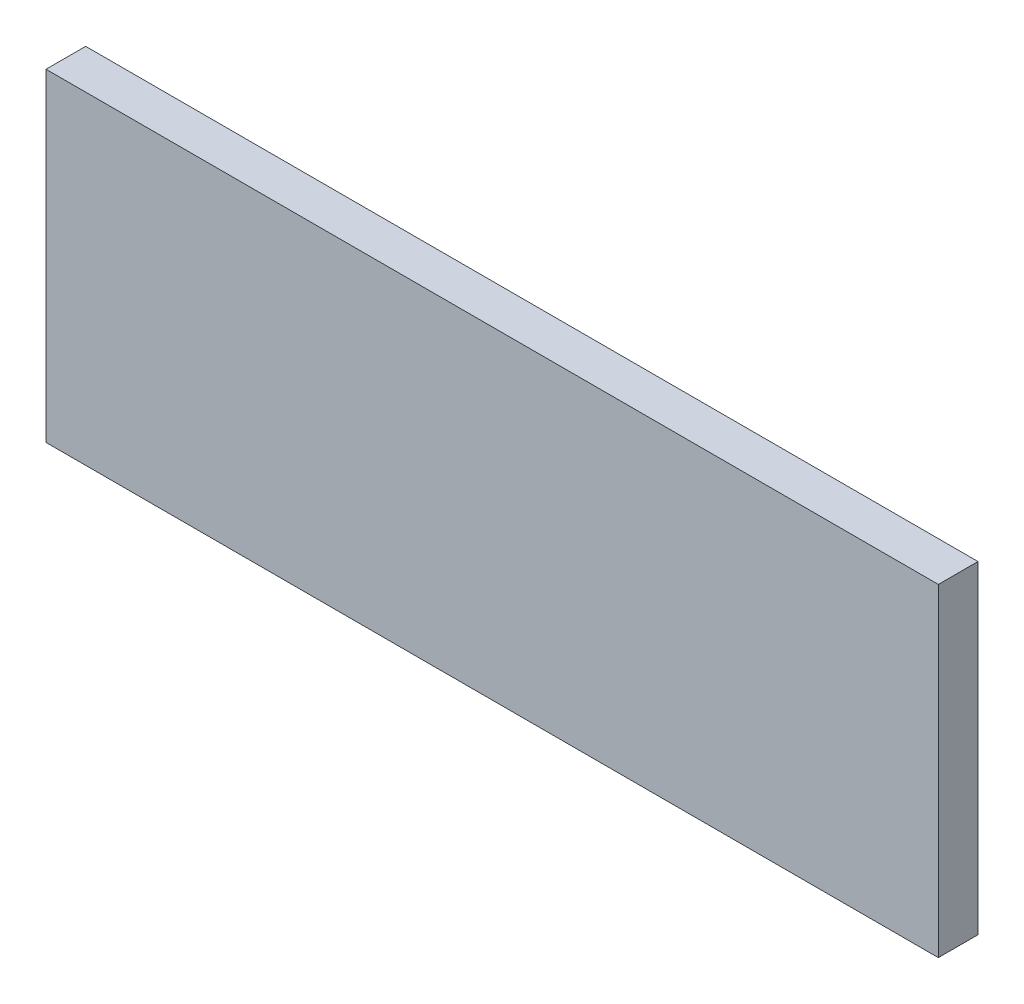
ISO-10303-21;
HEADER;
FILE_DESCRIPTION(('STEP AP214'),'2;1');
FILE_NAME('part.step','',(''),(''),'','','');
FILE_SCHEMA(('AUTOMOTIVE_DESIGN { 1 0 10303 214 1 1 1 1 }'));
ENDSEC;
DATA;
#1=APPLICATION_CONTEXT('core data for automotive mechanical design processes');
#2=APPLICATION_PROTOCOL_DEFINITION('international standard','automotive_design',2000,#1);
#3=PRODUCT_CONTEXT('',#1,'mechanical');
#4=PRODUCT('Part','Part','',(#3));
#5=PRODUCT_RELATED_PRODUCT_CATEGORY('part','',(#4));
#6=PRODUCT_DEFINITION_FORMATION('','',#4);
#7=PRODUCT_DEFINITION_CONTEXT('part definition',#1,'design');
#8=PRODUCT_DEFINITION('design','',#6,#7);
#9=PRODUCT_DEFINITION_SHAPE('','',#8);
#10=(LENGTH_UNIT() NAMED_UNIT(*) SI_UNIT(.MILLI.,.METRE.));
#11=(NAMED_UNIT(*) PLANE_ANGLE_UNIT() SI_UNIT($,.RADIAN.));
#12=(NAMED_UNIT(*) SI_UNIT($,.STERADIAN.) SOLID_ANGLE_UNIT());
#13=UNCERTAINTY_MEASURE_WITH_UNIT(LENGTH_MEASURE(1.E-05),#10,'distance_accuracy_value','');
#14=(GEOMETRIC_REPRESENTATION_CONTEXT(3) GLOBAL_UNCERTAINTY_ASSIGNED_CONTEXT((#13)) GLOBAL_UNIT_ASSIGNED_CONTEXT((#10,
#11,#12)) REPRESENTATION_CONTEXT('',''));
#15=CARTESIAN_POINT('',(0.,0.,0.));
#16=DIRECTION('',(0.,0.,1.));
#17=DIRECTION('',(1.,0.,0.));
#18=AXIS2_PLACEMENT_3D('',#15,#16,#17);
#19=CARTESIAN_POINT('',(225.,-81.5,20.));
#20=DIRECTION('',(-1.,0.,0.));
#21=DIRECTION('',(0.,0.,1.));
#22=AXIS2_PLACEMENT_3D('',#19,#20,#21);
#23=PLANE('',#22);
#24=DIRECTION('',(0.,1.,0.));
#25=VECTOR('',#24,1.);
#26=CARTESIAN_POINT('',(225.,-81.5,0.));
#27=LINE('',#26,#25);
#28=CARTESIAN_POINT('',(225.,-81.5,0.));
#29=VERTEX_POINT('',#28);
#30=CARTESIAN_POINT('',(225.,81.5,0.));
#31=VERTEX_POINT('',#30);
#32=EDGE_CURVE('E106',#29,#31,#27,.T.);
#33=ORIENTED_EDGE('',*,*,#32,.T.);
#34=DIRECTION('',(0.,0.,-1.));
#35=VECTOR('',#34,1.);
#36=CARTESIAN_POINT('',(225.,81.5,20.));
#37=LINE('',#36,#35);
#38=CARTESIAN_POINT('',(225.,81.5,20.));
#39=VERTEX_POINT('',#38);
#40=EDGE_CURVE('E11',#39,#31,#37,.T.);
#41=ORIENTED_EDGE('',*,*,#40,.F.);
#42=DIRECTION('',(0.,1.,0.));
#43=VECTOR('',#42,1.);
#44=CARTESIAN_POINT('',(225.,-81.5,20.));
#45=LINE('',#44,#43);
#46=CARTESIAN_POINT('',(225.,-81.5,20.));
#47=VERTEX_POINT('',#46);
#48=EDGE_CURVE('E90',#47,#39,#45,.T.);
#49=ORIENTED_EDGE('',*,*,#48,.F.);
#50=DIRECTION('',(0.,0.,-1.));
#51=VECTOR('',#50,1.);
#52=CARTESIAN_POINT('',(225.,-81.5,20.));
#53=LINE('',#52,#51);
#54=EDGE_CURVE('E102',#47,#29,#53,.T.);
#55=ORIENTED_EDGE('',*,*,#54,.T.);
#56=EDGE_LOOP('',(#33,#41,#49,#55));
#57=FACE_BOUND('',#56,.T.);
#58=ADVANCED_FACE('F38',(#57),#23,.F.);
#59=CARTESIAN_POINT('',(-225.,81.5,20.));
#60=DIRECTION('',(0.,-1.,0.));
#61=DIRECTION('',(0.,0.,-1.));
#62=AXIS2_PLACEMENT_3D('',#59,#60,#61);
#63=PLANE('',#62);
#64=DIRECTION('',(-1.,0.,0.));
#65=VECTOR('',#64,1.);
#66=CARTESIAN_POINT('',(-225.,81.5,0.));
#67=LINE('',#66,#65);
#68=CARTESIAN_POINT('',(-225.,81.5,0.));
#69=VERTEX_POINT('',#68);
#70=EDGE_CURVE('E95',#31,#69,#67,.T.);
#71=ORIENTED_EDGE('',*,*,#70,.T.);
#72=DIRECTION('',(0.,0.,-1.));
#73=VECTOR('',#72,1.);
#74=CARTESIAN_POINT('',(-225.,81.5,20.));
#75=LINE('',#74,#73);
#76=CARTESIAN_POINT('',(-225.,81.5,20.));
#77=VERTEX_POINT('',#76);
#78=EDGE_CURVE('E47',#77,#69,#75,.T.);
#79=ORIENTED_EDGE('',*,*,#78,.F.);
#80=DIRECTION('',(-1.,0.,0.));
#81=VECTOR('',#80,1.);
#82=CARTESIAN_POINT('',(-225.,81.5,20.));
#83=LINE('',#82,#81);
#84=EDGE_CURVE('E85',#39,#77,#83,.T.);
#85=ORIENTED_EDGE('',*,*,#84,.F.);
#86=ORIENTED_EDGE('',*,*,#40,.T.);
#87=EDGE_LOOP('',(#71,#79,#85,#86));
#88=FACE_BOUND('',#87,.T.);
#89=ADVANCED_FACE('F94',(#88),#63,.F.);
#90=CARTESIAN_POINT('',(-225.,-81.5,20.));
#91=DIRECTION('',(1.,0.,0.));
#92=DIRECTION('',(0.,0.,-1.));
#93=AXIS2_PLACEMENT_3D('',#90,#91,#92);
#94=PLANE('',#93);
#95=DIRECTION('',(0.,-1.,0.));
#96=VECTOR('',#95,1.);
#97=CARTESIAN_POINT('',(-225.,-81.5,0.));
#98=LINE('',#97,#96);
#99=CARTESIAN_POINT('',(-225.,-81.5,0.));
#100=VERTEX_POINT('',#99);
#101=EDGE_CURVE('E72',#69,#100,#98,.T.);
#102=ORIENTED_EDGE('',*,*,#101,.T.);
#103=DIRECTION('',(0.,0.,-1.));
#104=VECTOR('',#103,1.);
#105=CARTESIAN_POINT('',(-225.,-81.5,20.));
#106=LINE('',#105,#104);
#107=CARTESIAN_POINT('',(-225.,-81.5,20.));
#108=VERTEX_POINT('',#107);
#109=EDGE_CURVE('E97',#108,#100,#106,.T.);
#110=ORIENTED_EDGE('',*,*,#109,.F.);
#111=DIRECTION('',(0.,-1.,0.));
#112=VECTOR('',#111,1.);
#113=CARTESIAN_POINT('',(-225.,-81.5,20.));
#114=LINE('',#113,#112);
#115=EDGE_CURVE('E88',#77,#108,#114,.T.);
#116=ORIENTED_EDGE('',*,*,#115,.F.);
#117=ORIENTED_EDGE('',*,*,#78,.T.);
#118=EDGE_LOOP('',(#102,#110,#116,#117));
#119=FACE_BOUND('',#118,.T.);
#120=ADVANCED_FACE('F98',(#119),#94,.F.);
#121=CARTESIAN_POINT('',(-225.,-81.5,20.));
#122=DIRECTION('',(0.,1.,0.));
#123=DIRECTION('',(0.,0.,1.));
#124=AXIS2_PLACEMENT_3D('',#121,#122,#123);
#125=PLANE('',#124);
#126=DIRECTION('',(1.,0.,0.));
#127=VECTOR('',#126,1.);
#128=CARTESIAN_POINT('',(-225.,-81.5,0.));
#129=LINE('',#128,#127);
#130=EDGE_CURVE('E78',#100,#29,#129,.T.);
#131=ORIENTED_EDGE('',*,*,#130,.T.);
#132=ORIENTED_EDGE('',*,*,#54,.F.);
#133=DIRECTION('',(1.,0.,0.));
#134=VECTOR('',#133,1.);
#135=CARTESIAN_POINT('',(-225.,-81.5,20.));
#136=LINE('',#135,#134);
#137=EDGE_CURVE('E55',#108,#47,#136,.T.);
#138=ORIENTED_EDGE('',*,*,#137,.F.);
#139=ORIENTED_EDGE('',*,*,#109,.T.);
#140=EDGE_LOOP('',(#131,#132,#138,#139));
#141=FACE_BOUND('',#140,.T.);
#142=ADVANCED_FACE('F119',(#141),#125,.F.);
#143=CARTESIAN_POINT('',(0.,0.,20.));
#144=DIRECTION('',(0.,0.,-1.));
#145=DIRECTION('',(-1.,0.,0.));
#146=AXIS2_PLACEMENT_3D('',#143,#144,#145);
#147=PLANE('',#146);
#148=ORIENTED_EDGE('',*,*,#48,.T.);
#149=ORIENTED_EDGE('',*,*,#84,.T.);
#150=ORIENTED_EDGE('',*,*,#115,.T.);
#151=ORIENTED_EDGE('',*,*,#137,.T.);
#152=EDGE_LOOP('',(#148,#149,#150,#151));
#153=FACE_BOUND('',#152,.T.);
#154=ADVANCED_FACE('F86',(#153),#147,.F.);
#155=CARTESIAN_POINT('',(0.,0.,0.));
#156=DIRECTION('',(0.,0.,-1.));
#157=DIRECTION('',(-1.,0.,0.));
#158=AXIS2_PLACEMENT_3D('',#155,#156,#157);
#159=PLANE('',#158);
#160=ORIENTED_EDGE('',*,*,#32,.F.);
#161=ORIENTED_EDGE('',*,*,#130,.F.);
#162=ORIENTED_EDGE('',*,*,#101,.F.);
#163=ORIENTED_EDGE('',*,*,#70,.F.);
#164=EDGE_LOOP('',(#160,#161,#162,#163));
#165=FACE_BOUND('',#164,.T.);
#166=ADVANCED_FACE('F122',(#165),#159,.T.);
#167=CLOSED_SHELL('',(#58,#89,#120,#142,#154,#166));
#168=MANIFOLD_SOLID_BREP('B2',#167);
#169=ADVANCED_BREP_SHAPE_REPRESENTATION('',(#18,#168),#14);
#170=SHAPE_DEFINITION_REPRESENTATION(#9,#169);
ENDSEC;
END-ISO-10303-21;
